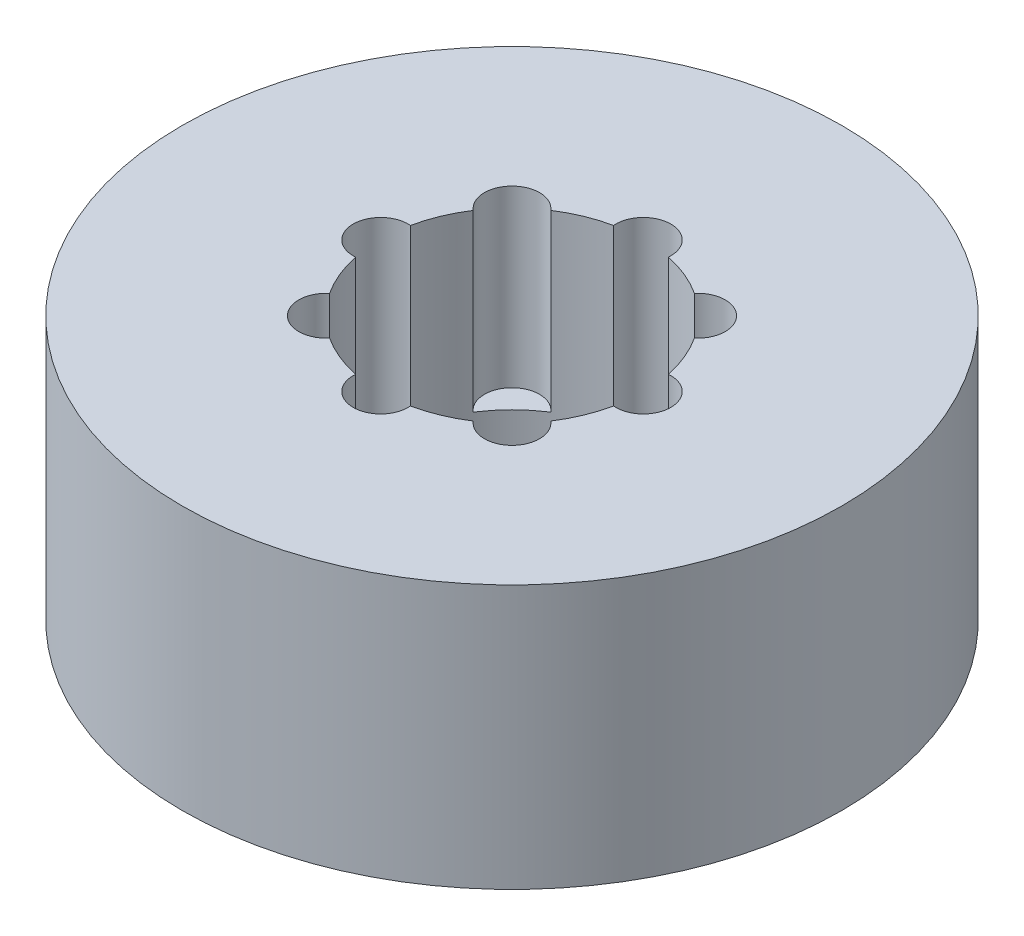
ISO-10303-21;
HEADER;
FILE_DESCRIPTION(('STEP AP214'),'2;1');
FILE_NAME('part.step','',(''),(''),'','','');
FILE_SCHEMA(('AUTOMOTIVE_DESIGN { 1 0 10303 214 1 1 1 1 }'));
ENDSEC;
DATA;
#1=APPLICATION_CONTEXT('core data for automotive mechanical design processes');
#2=APPLICATION_PROTOCOL_DEFINITION('international standard','automotive_design',2000,#1);
#3=PRODUCT_CONTEXT('',#1,'mechanical');
#4=PRODUCT('Part','Part','',(#3));
#5=PRODUCT_RELATED_PRODUCT_CATEGORY('part','',(#4));
#6=PRODUCT_DEFINITION_FORMATION('','',#4);
#7=PRODUCT_DEFINITION_CONTEXT('part definition',#1,'design');
#8=PRODUCT_DEFINITION('design','',#6,#7);
#9=PRODUCT_DEFINITION_SHAPE('','',#8);
#10=(LENGTH_UNIT() NAMED_UNIT(*) SI_UNIT(.MILLI.,.METRE.));
#11=(NAMED_UNIT(*) PLANE_ANGLE_UNIT() SI_UNIT($,.RADIAN.));
#12=(NAMED_UNIT(*) SI_UNIT($,.STERADIAN.) SOLID_ANGLE_UNIT());
#13=UNCERTAINTY_MEASURE_WITH_UNIT(LENGTH_MEASURE(1.E-05),#10,'distance_accuracy_value','');
#14=(GEOMETRIC_REPRESENTATION_CONTEXT(3) GLOBAL_UNCERTAINTY_ASSIGNED_CONTEXT((#13)) GLOBAL_UNIT_ASSIGNED_CONTEXT((#10,
#11,#12)) REPRESENTATION_CONTEXT('',''));
#15=CARTESIAN_POINT('',(0.,0.,0.));
#16=DIRECTION('',(0.,0.,1.));
#17=DIRECTION('',(1.,0.,0.));
#18=AXIS2_PLACEMENT_3D('',#15,#16,#17);
#19=CARTESIAN_POINT('',(0.,20.,0.));
#20=DIRECTION('',(0.,-1.,0.));
#21=DIRECTION('',(0.,0.,-1.));
#22=AXIS2_PLACEMENT_3D('',#19,#20,#21);
#23=CYLINDRICAL_SURFACE('',#22,25.);
#24=CARTESIAN_POINT('',(0.,20.,0.));
#25=DIRECTION('',(0.,1.,0.));
#26=DIRECTION('',(0.,0.,1.));
#27=AXIS2_PLACEMENT_3D('',#24,#25,#26);
#28=CIRCLE('',#27,25.);
#29=CARTESIAN_POINT('',(0.,20.,25.));
#30=VERTEX_POINT('',#29);
#31=EDGE_CURVE('E195',#30,#30,#28,.T.);
#32=ORIENTED_EDGE('',*,*,#31,.F.);
#33=EDGE_LOOP('',(#32));
#34=FACE_BOUND('',#33,.T.);
#35=CARTESIAN_POINT('',(0.,0.,0.));
#36=DIRECTION('',(0.,1.,0.));
#37=DIRECTION('',(0.,0.,1.));
#38=AXIS2_PLACEMENT_3D('',#35,#36,#37);
#39=CIRCLE('',#38,25.);
#40=CARTESIAN_POINT('',(0.,0.,25.));
#41=VERTEX_POINT('',#40);
#42=EDGE_CURVE('E179',#41,#41,#39,.T.);
#43=ORIENTED_EDGE('',*,*,#42,.T.);
#44=EDGE_LOOP('',(#43));
#45=FACE_BOUND('',#44,.T.);
#46=ADVANCED_FACE('F39',(#34,#45),#23,.T.);
#47=CARTESIAN_POINT('',(0.,20.,0.));
#48=DIRECTION('',(0.,1.,0.));
#49=DIRECTION('',(0.,0.,1.));
#50=AXIS2_PLACEMENT_3D('',#47,#48,#49);
#51=PLANE('',#50);
#52=CARTESIAN_POINT('',(0.,20.,9.95756158068621));
#53=DIRECTION('',(0.,1.,0.));
#54=DIRECTION('',(1.,0.,0.));
#55=AXIS2_PLACEMENT_3D('',#52,#53,#54);
#56=CIRCLE('',#55,2.08700614775945);
#57=CARTESIAN_POINT('',(-2.07955658889209,20.,9.78138253998869));
#58=VERTEX_POINT('',#57);
#59=CARTESIAN_POINT('',(2.07955658889215,20.,9.78138253998867));
#60=VERTEX_POINT('',#59);
#61=EDGE_CURVE('E176',#58,#60,#56,.T.);
#62=ORIENTED_EDGE('',*,*,#61,.F.);
#63=CARTESIAN_POINT('',(0.,20.,0.));
#64=DIRECTION('',(0.,1.,0.));
#65=DIRECTION('',(0.,0.,1.));
#66=AXIS2_PLACEMENT_3D('',#63,#64,#65);
#67=CIRCLE('',#66,10.);
#68=CARTESIAN_POINT('',(-5.44601335753889,20.,8.38695048927248));
#69=VERTEX_POINT('',#68);
#70=EDGE_CURVE('E166',#69,#58,#67,.T.);
#71=ORIENTED_EDGE('',*,*,#70,.F.);
#72=CARTESIAN_POINT('',(-7.04105931778585,20.,7.04105931778587));
#73=DIRECTION('',(0.,1.,0.));
#74=DIRECTION('',(0.707106781186549,0.,0.707106781186546));
#75=AXIS2_PLACEMENT_3D('',#72,#73,#74);
#76=CIRCLE('',#75,2.08700614775945);
#77=CARTESIAN_POINT('',(-8.38695048927246,20.,5.44601335753892));
#78=VERTEX_POINT('',#77);
#79=EDGE_CURVE('E147',#78,#69,#76,.T.);
#80=ORIENTED_EDGE('',*,*,#79,.F.);
#81=CARTESIAN_POINT('',(-9.78138253998868,20.,2.07955658889212));
#82=VERTEX_POINT('',#81);
#83=EDGE_CURVE('E180',#82,#78,#67,.T.);
#84=ORIENTED_EDGE('',*,*,#83,.F.);
#85=CARTESIAN_POINT('',(-9.95756158068621,20.,0.));
#86=DIRECTION('',(0.,1.,0.));
#87=DIRECTION('',(0.,0.,1.));
#88=AXIS2_PLACEMENT_3D('',#85,#86,#87);
#89=CIRCLE('',#88,2.08700614775945);
#90=CARTESIAN_POINT('',(-9.78138253998868,20.,-2.07955658889212));
#91=VERTEX_POINT('',#90);
#92=EDGE_CURVE('E186',#91,#82,#89,.T.);
#93=ORIENTED_EDGE('',*,*,#92,.F.);
#94=CARTESIAN_POINT('',(-8.38695048927254,20.,-5.44601335753881));
#95=VERTEX_POINT('',#94);
#96=EDGE_CURVE('E182',#95,#91,#67,.T.);
#97=ORIENTED_EDGE('',*,*,#96,.F.);
#98=CARTESIAN_POINT('',(-7.04105931778594,20.,-7.04105931778577));
#99=DIRECTION('',(0.,1.,0.));
#100=DIRECTION('',(-0.707106781186539,0.,0.707106781186556));
#101=AXIS2_PLACEMENT_3D('',#98,#99,#100);
#102=CIRCLE('',#101,2.08700614775945);
#103=CARTESIAN_POINT('',(-5.44601335753901,20.,-8.38695048927241));
#104=VERTEX_POINT('',#103);
#105=EDGE_CURVE('E446',#104,#95,#102,.T.);
#106=ORIENTED_EDGE('',*,*,#105,.F.);
#107=CARTESIAN_POINT('',(-2.07955658889222,20.,-9.78138253998866));
#108=VERTEX_POINT('',#107);
#109=EDGE_CURVE('E452',#108,#104,#67,.T.);
#110=ORIENTED_EDGE('',*,*,#109,.F.);
#111=CARTESIAN_POINT('',(-1.04299921318042E-13,20.,-9.95756158068621));
#112=DIRECTION('',(0.,1.,0.));
#113=DIRECTION('',(-1.,0.,0.));
#114=AXIS2_PLACEMENT_3D('',#111,#112,#113);
#115=CIRCLE('',#114,2.08700614775945);
#116=CARTESIAN_POINT('',(2.07955658889202,20.,-9.7813825399887));
#117=VERTEX_POINT('',#116);
#118=EDGE_CURVE('E477',#117,#108,#115,.T.);
#119=ORIENTED_EDGE('',*,*,#118,.F.);
#120=CARTESIAN_POINT('',(5.44601335753883,20.,-8.38695048927252));
#121=VERTEX_POINT('',#120);
#122=EDGE_CURVE('E460',#121,#117,#67,.T.);
#123=ORIENTED_EDGE('',*,*,#122,.F.);
#124=CARTESIAN_POINT('',(7.0410593177858,20.,-7.04105931778592));
#125=DIRECTION('',(0.,1.,0.));
#126=DIRECTION('',(-0.707106781186554,0.,-0.707106781186541));
#127=AXIS2_PLACEMENT_3D('',#124,#125,#126);
#128=CIRCLE('',#127,2.08700614775945);
#129=CARTESIAN_POINT('',(8.38695048927243,20.,-5.44601335753898));
#130=VERTEX_POINT('',#129);
#131=EDGE_CURVE('E464',#130,#121,#128,.T.);
#132=ORIENTED_EDGE('',*,*,#131,.F.);
#133=CARTESIAN_POINT('',(9.78138253998868,20.,-2.07955658889212));
#134=VERTEX_POINT('',#133);
#135=EDGE_CURVE('E459',#134,#130,#67,.T.);
#136=ORIENTED_EDGE('',*,*,#135,.F.);
#137=CARTESIAN_POINT('',(9.95756158068621,20.,0.));
#138=DIRECTION('',(0.,1.,0.));
#139=DIRECTION('',(0.,0.,-1.));
#140=AXIS2_PLACEMENT_3D('',#137,#138,#139);
#141=CIRCLE('',#140,2.08700614775945);
#142=CARTESIAN_POINT('',(9.78138253998868,20.,2.07955658889212));
#143=VERTEX_POINT('',#142);
#144=EDGE_CURVE('E469',#143,#134,#141,.T.);
#145=ORIENTED_EDGE('',*,*,#144,.F.);
#146=CARTESIAN_POINT('',(8.3869504892725,20.,5.44601335753886));
#147=VERTEX_POINT('',#146);
#148=EDGE_CURVE('E181',#147,#143,#67,.T.);
#149=ORIENTED_EDGE('',*,*,#148,.F.);
#150=CARTESIAN_POINT('',(7.0410593177859,20.,7.04105931778582));
#151=DIRECTION('',(0.,1.,0.));
#152=DIRECTION('',(0.707106781186544,0.,-0.707106781186551));
#153=AXIS2_PLACEMENT_3D('',#150,#151,#152);
#154=CIRCLE('',#153,2.08700614775945);
#155=CARTESIAN_POINT('',(5.44601335753895,20.,8.38695048927245));
#156=VERTEX_POINT('',#155);
#157=EDGE_CURVE('E475',#156,#147,#154,.T.);
#158=ORIENTED_EDGE('',*,*,#157,.F.);
#159=EDGE_CURVE('E177',#60,#156,#67,.T.);
#160=ORIENTED_EDGE('',*,*,#159,.F.);
#161=EDGE_LOOP('',(#62,#71,#80,#84,#93,#97,#106,#110,#119,#123,#132,#136,#145,#149,#158,#160));
#162=FACE_BOUND('',#161,.T.);
#163=ORIENTED_EDGE('',*,*,#31,.T.);
#164=EDGE_LOOP('',(#163));
#165=FACE_BOUND('',#164,.T.);
#166=ADVANCED_FACE('F172',(#162,#165),#51,.T.);
#167=CARTESIAN_POINT('',(0.,0.,0.));
#168=DIRECTION('',(0.,1.,0.));
#169=DIRECTION('',(0.,0.,1.));
#170=AXIS2_PLACEMENT_3D('',#167,#168,#169);
#171=PLANE('',#170);
#172=CARTESIAN_POINT('',(0.,0.,0.));
#173=DIRECTION('',(0.,1.,0.));
#174=DIRECTION('',(0.,0.,1.));
#175=AXIS2_PLACEMENT_3D('',#172,#173,#174);
#176=CIRCLE('',#175,10.);
#177=CARTESIAN_POINT('',(0.,0.,10.));
#178=VERTEX_POINT('',#177);
#179=EDGE_CURVE('E187',#178,#178,#176,.T.);
#180=ORIENTED_EDGE('',*,*,#179,.T.);
#181=EDGE_LOOP('',(#180));
#182=FACE_BOUND('',#181,.T.);
#183=ORIENTED_EDGE('',*,*,#42,.F.);
#184=EDGE_LOOP('',(#183));
#185=FACE_BOUND('',#184,.T.);
#186=ADVANCED_FACE('F270',(#182,#185),#171,.F.);
#187=CARTESIAN_POINT('',(0.,20.,0.));
#188=DIRECTION('',(0.,-1.,0.));
#189=DIRECTION('',(0.,0.,-1.));
#190=AXIS2_PLACEMENT_3D('',#187,#188,#189);
#191=CYLINDRICAL_SURFACE('',#190,10.);
#192=DIRECTION('',(0.,1.,0.));
#193=VECTOR('',#192,1.);
#194=CARTESIAN_POINT('',(-2.07955658889209,13.3775208247682,9.78138253998869));
#195=LINE('',#194,#193);
#196=CARTESIAN_POINT('',(-2.07955658889209,6.75504164953644,9.78138253998869));
#197=VERTEX_POINT('',#196);
#198=EDGE_CURVE('E11',#197,#58,#195,.T.);
#199=ORIENTED_EDGE('',*,*,#198,.F.);
#200=CARTESIAN_POINT('',(0.,6.75504164953644,0.));
#201=DIRECTION('',(0.,1.,0.));
#202=DIRECTION('',(0.,0.,1.));
#203=AXIS2_PLACEMENT_3D('',#200,#201,#202);
#204=CIRCLE('',#203,10.);
#205=CARTESIAN_POINT('',(2.07955658889215,6.75504164953644,9.78138253998867));
#206=VERTEX_POINT('',#205);
#207=EDGE_CURVE('E250',#197,#206,#204,.T.);
#208=ORIENTED_EDGE('',*,*,#207,.T.);
#209=DIRECTION('',(0.,1.,0.));
#210=VECTOR('',#209,1.);
#211=CARTESIAN_POINT('',(2.07955658889215,13.3775208247682,9.78138253998867));
#212=LINE('',#211,#210);
#213=EDGE_CURVE('E46',#60,#206,#212,.F.);
#214=ORIENTED_EDGE('',*,*,#213,.F.);
#215=ORIENTED_EDGE('',*,*,#159,.T.);
#216=DIRECTION('',(0.,1.,0.));
#217=VECTOR('',#216,1.);
#218=CARTESIAN_POINT('',(5.44601335753895,13.3775208247682,8.38695048927245));
#219=LINE('',#218,#217);
#220=CARTESIAN_POINT('',(5.44601335753895,6.75504164953644,8.38695048927245));
#221=VERTEX_POINT('',#220);
#222=EDGE_CURVE('E244',#221,#156,#219,.T.);
#223=ORIENTED_EDGE('',*,*,#222,.F.);
#224=CARTESIAN_POINT('',(0.,6.75504164953644,0.));
#225=DIRECTION('',(0.,1.,0.));
#226=DIRECTION('',(0.,0.,1.));
#227=AXIS2_PLACEMENT_3D('',#224,#225,#226);
#228=CIRCLE('',#227,10.);
#229=CARTESIAN_POINT('',(8.3869504892725,6.75504164953644,5.44601335753886));
#230=VERTEX_POINT('',#229);
#231=EDGE_CURVE('E238',#221,#230,#228,.T.);
#232=ORIENTED_EDGE('',*,*,#231,.T.);
#233=DIRECTION('',(0.,1.,0.));
#234=VECTOR('',#233,1.);
#235=CARTESIAN_POINT('',(8.3869504892725,13.3775208247682,5.44601335753886));
#236=LINE('',#235,#234);
#237=EDGE_CURVE('E242',#147,#230,#236,.F.);
#238=ORIENTED_EDGE('',*,*,#237,.F.);
#239=ORIENTED_EDGE('',*,*,#148,.T.);
#240=DIRECTION('',(0.,1.,0.));
#241=VECTOR('',#240,1.);
#242=CARTESIAN_POINT('',(9.78138253998868,13.3775208247682,2.07955658889212));
#243=LINE('',#242,#241);
#244=CARTESIAN_POINT('',(9.78138253998868,6.75504164953644,2.07955658889212));
#245=VERTEX_POINT('',#244);
#246=EDGE_CURVE('E236',#245,#143,#243,.T.);
#247=ORIENTED_EDGE('',*,*,#246,.F.);
#248=CARTESIAN_POINT('',(0.,6.75504164953644,0.));
#249=DIRECTION('',(0.,1.,0.));
#250=DIRECTION('',(0.,0.,1.));
#251=AXIS2_PLACEMENT_3D('',#248,#249,#250);
#252=CIRCLE('',#251,10.);
#253=CARTESIAN_POINT('',(9.78138253998868,6.75504164953644,-2.07955658889212));
#254=VERTEX_POINT('',#253);
#255=EDGE_CURVE('E235',#245,#254,#252,.T.);
#256=ORIENTED_EDGE('',*,*,#255,.T.);
#257=DIRECTION('',(0.,1.,0.));
#258=VECTOR('',#257,1.);
#259=CARTESIAN_POINT('',(9.78138253998868,13.3775208247682,-2.07955658889212));
#260=LINE('',#259,#258);
#261=EDGE_CURVE('E234',#134,#254,#260,.F.);
#262=ORIENTED_EDGE('',*,*,#261,.F.);
#263=ORIENTED_EDGE('',*,*,#135,.T.);
#264=DIRECTION('',(0.,1.,0.));
#265=VECTOR('',#264,1.);
#266=CARTESIAN_POINT('',(8.38695048927243,13.3775208247682,-5.44601335753898));
#267=LINE('',#266,#265);
#268=CARTESIAN_POINT('',(8.38695048927243,6.75504164953644,-5.44601335753898));
#269=VERTEX_POINT('',#268);
#270=EDGE_CURVE('E229',#269,#130,#267,.T.);
#271=ORIENTED_EDGE('',*,*,#270,.F.);
#272=CARTESIAN_POINT('',(0.,6.75504164953644,0.));
#273=DIRECTION('',(0.,1.,0.));
#274=DIRECTION('',(0.,0.,1.));
#275=AXIS2_PLACEMENT_3D('',#272,#273,#274);
#276=CIRCLE('',#275,10.);
#277=CARTESIAN_POINT('',(5.44601335753883,6.75504164953644,-8.38695048927252));
#278=VERTEX_POINT('',#277);
#279=EDGE_CURVE('E221',#269,#278,#276,.T.);
#280=ORIENTED_EDGE('',*,*,#279,.T.);
#281=DIRECTION('',(0.,1.,0.));
#282=VECTOR('',#281,1.);
#283=CARTESIAN_POINT('',(5.44601335753883,13.3775208247682,-8.38695048927252));
#284=LINE('',#283,#282);
#285=EDGE_CURVE('E230',#121,#278,#284,.F.);
#286=ORIENTED_EDGE('',*,*,#285,.F.);
#287=ORIENTED_EDGE('',*,*,#122,.T.);
#288=DIRECTION('',(0.,1.,0.));
#289=VECTOR('',#288,1.);
#290=CARTESIAN_POINT('',(2.07955658889202,13.3775208247682,-9.7813825399887));
#291=LINE('',#290,#289);
#292=CARTESIAN_POINT('',(2.07955658889202,6.75504164953644,-9.7813825399887));
#293=VERTEX_POINT('',#292);
#294=EDGE_CURVE('E225',#293,#117,#291,.T.);
#295=ORIENTED_EDGE('',*,*,#294,.F.);
#296=CARTESIAN_POINT('',(0.,6.75504164953644,0.));
#297=DIRECTION('',(0.,1.,0.));
#298=DIRECTION('',(0.,0.,1.));
#299=AXIS2_PLACEMENT_3D('',#296,#297,#298);
#300=CIRCLE('',#299,10.);
#301=CARTESIAN_POINT('',(-2.07955658889222,6.75504164953644,-9.78138253998866));
#302=VERTEX_POINT('',#301);
#303=EDGE_CURVE('E216',#293,#302,#300,.T.);
#304=ORIENTED_EDGE('',*,*,#303,.T.);
#305=DIRECTION('',(0.,1.,0.));
#306=VECTOR('',#305,1.);
#307=CARTESIAN_POINT('',(-2.07955658889222,13.3775208247682,-9.78138253998866));
#308=LINE('',#307,#306);
#309=EDGE_CURVE('E218',#108,#302,#308,.F.);
#310=ORIENTED_EDGE('',*,*,#309,.F.);
#311=ORIENTED_EDGE('',*,*,#109,.T.);
#312=DIRECTION('',(0.,1.,0.));
#313=VECTOR('',#312,1.);
#314=CARTESIAN_POINT('',(-5.44601335753901,13.3775208247682,-8.38695048927241));
#315=LINE('',#314,#313);
#316=CARTESIAN_POINT('',(-5.44601335753901,6.75504164953644,-8.38695048927241));
#317=VERTEX_POINT('',#316);
#318=EDGE_CURVE('E212',#317,#104,#315,.T.);
#319=ORIENTED_EDGE('',*,*,#318,.F.);
#320=CARTESIAN_POINT('',(0.,6.75504164953644,0.));
#321=DIRECTION('',(0.,1.,0.));
#322=DIRECTION('',(0.,0.,1.));
#323=AXIS2_PLACEMENT_3D('',#320,#321,#322);
#324=CIRCLE('',#323,10.);
#325=CARTESIAN_POINT('',(-8.38695048927254,6.75504164953644,-5.44601335753881));
#326=VERTEX_POINT('',#325);
#327=EDGE_CURVE('E208',#317,#326,#324,.T.);
#328=ORIENTED_EDGE('',*,*,#327,.T.);
#329=DIRECTION('',(0.,1.,0.));
#330=VECTOR('',#329,1.);
#331=CARTESIAN_POINT('',(-8.38695048927254,13.3775208247682,-5.44601335753881));
#332=LINE('',#331,#330);
#333=EDGE_CURVE('E211',#95,#326,#332,.F.);
#334=ORIENTED_EDGE('',*,*,#333,.F.);
#335=ORIENTED_EDGE('',*,*,#96,.T.);
#336=DIRECTION('',(0.,1.,0.));
#337=VECTOR('',#336,1.);
#338=CARTESIAN_POINT('',(-9.78138253998868,13.3775208247682,-2.07955658889212));
#339=LINE('',#338,#337);
#340=CARTESIAN_POINT('',(-9.78138253998868,6.75504164953644,-2.07955658889212));
#341=VERTEX_POINT('',#340);
#342=EDGE_CURVE('E201',#341,#91,#339,.T.);
#343=ORIENTED_EDGE('',*,*,#342,.F.);
#344=CARTESIAN_POINT('',(0.,6.75504164953644,0.));
#345=DIRECTION('',(0.,1.,0.));
#346=DIRECTION('',(0.,0.,1.));
#347=AXIS2_PLACEMENT_3D('',#344,#345,#346);
#348=CIRCLE('',#347,10.);
#349=CARTESIAN_POINT('',(-9.78138253998868,6.75504164953644,2.07955658889212));
#350=VERTEX_POINT('',#349);
#351=EDGE_CURVE('E194',#341,#350,#348,.T.);
#352=ORIENTED_EDGE('',*,*,#351,.T.);
#353=DIRECTION('',(0.,1.,0.));
#354=VECTOR('',#353,1.);
#355=CARTESIAN_POINT('',(-9.78138253998868,13.3775208247682,2.07955658889212));
#356=LINE('',#355,#354);
#357=EDGE_CURVE('E199',#82,#350,#356,.F.);
#358=ORIENTED_EDGE('',*,*,#357,.F.);
#359=ORIENTED_EDGE('',*,*,#83,.T.);
#360=DIRECTION('',(0.,1.,0.));
#361=VECTOR('',#360,1.);
#362=CARTESIAN_POINT('',(-8.38695048927247,13.3775208247682,5.44601335753892));
#363=LINE('',#362,#361);
#364=CARTESIAN_POINT('',(-8.38695048927246,6.75504164953644,5.44601335753892));
#365=VERTEX_POINT('',#364);
#366=EDGE_CURVE('E160',#365,#78,#363,.T.);
#367=ORIENTED_EDGE('',*,*,#366,.F.);
#368=CARTESIAN_POINT('',(0.,6.75504164953644,0.));
#369=DIRECTION('',(0.,1.,0.));
#370=DIRECTION('',(0.,0.,1.));
#371=AXIS2_PLACEMENT_3D('',#368,#369,#370);
#372=CIRCLE('',#371,10.);
#373=CARTESIAN_POINT('',(-5.44601335753889,6.75504164953644,8.38695048927248));
#374=VERTEX_POINT('',#373);
#375=EDGE_CURVE('E168',#365,#374,#372,.T.);
#376=ORIENTED_EDGE('',*,*,#375,.T.);
#377=DIRECTION('',(0.,1.,0.));
#378=VECTOR('',#377,1.);
#379=CARTESIAN_POINT('',(-5.44601335753889,13.3775208247682,8.38695048927248));
#380=LINE('',#379,#378);
#381=EDGE_CURVE('E152',#69,#374,#380,.F.);
#382=ORIENTED_EDGE('',*,*,#381,.F.);
#383=ORIENTED_EDGE('',*,*,#70,.T.);
#384=EDGE_LOOP('',(#199,#208,#214,#215,#223,#232,#238,#239,#247,#256,#262,#263,#271,#280,#286,
#287,#295,#304,#310,#311,#319,#328,#334,#335,#343,#352,#358,#359,#367,#376,#382,#383));
#385=FACE_BOUND('',#384,.T.);
#386=ORIENTED_EDGE('',*,*,#179,.F.);
#387=EDGE_LOOP('',(#386));
#388=FACE_BOUND('',#387,.T.);
#389=ADVANCED_FACE('F170',(#385,#388),#191,.F.);
#390=CARTESIAN_POINT('',(-9.95756158068621,6.75504164953644,0.));
#391=DIRECTION('',(0.,1.,0.));
#392=DIRECTION('',(0.,0.,1.));
#393=AXIS2_PLACEMENT_3D('',#390,#391,#392);
#394=CYLINDRICAL_SURFACE('',#393,2.08700614775945);
#395=ORIENTED_EDGE('',*,*,#342,.T.);
#396=ORIENTED_EDGE('',*,*,#92,.T.);
#397=ORIENTED_EDGE('',*,*,#357,.T.);
#398=CARTESIAN_POINT('',(-9.95756158068621,6.75504164953644,0.));
#399=DIRECTION('',(0.,1.,0.));
#400=DIRECTION('',(0.,0.,1.));
#401=AXIS2_PLACEMENT_3D('',#398,#399,#400);
#402=CIRCLE('',#401,2.08700614775945);
#403=EDGE_CURVE('E191',#341,#350,#402,.T.);
#404=ORIENTED_EDGE('',*,*,#403,.F.);
#405=EDGE_LOOP('',(#395,#396,#397,#404));
#406=FACE_BOUND('',#405,.T.);
#407=ADVANCED_FACE('F279',(#406),#394,.F.);
#408=CARTESIAN_POINT('',(-9.95756158068621,6.75504164953644,0.));
#409=DIRECTION('',(0.,1.,0.));
#410=DIRECTION('',(0.,0.,1.));
#411=AXIS2_PLACEMENT_3D('',#408,#409,#410);
#412=PLANE('',#411);
#413=ORIENTED_EDGE('',*,*,#403,.T.);
#414=ORIENTED_EDGE('',*,*,#351,.F.);
#415=EDGE_LOOP('',(#413,#414));
#416=FACE_BOUND('',#415,.T.);
#417=ADVANCED_FACE('F285',(#416),#412,.T.);
#418=CARTESIAN_POINT('',(-7.04105931778585,6.75504164953644,7.04105931778587));
#419=DIRECTION('',(0.,1.,0.));
#420=DIRECTION('',(0.,0.,1.));
#421=AXIS2_PLACEMENT_3D('',#418,#419,#420);
#422=CYLINDRICAL_SURFACE('',#421,2.08700614775945);
#423=ORIENTED_EDGE('',*,*,#366,.T.);
#424=ORIENTED_EDGE('',*,*,#79,.T.);
#425=ORIENTED_EDGE('',*,*,#381,.T.);
#426=CARTESIAN_POINT('',(-7.04105931778585,6.75504164953644,7.04105931778587));
#427=DIRECTION('',(0.,1.,0.));
#428=DIRECTION('',(0.707106781186549,0.,0.707106781186546));
#429=AXIS2_PLACEMENT_3D('',#426,#427,#428);
#430=CIRCLE('',#429,2.08700614775945);
#431=EDGE_CURVE('E165',#365,#374,#430,.T.);
#432=ORIENTED_EDGE('',*,*,#431,.F.);
#433=EDGE_LOOP('',(#423,#424,#425,#432));
#434=FACE_BOUND('',#433,.T.);
#435=ADVANCED_FACE('F155',(#434),#422,.F.);
#436=CARTESIAN_POINT('',(-7.04105931778585,6.75504164953644,7.04105931778587));
#437=DIRECTION('',(0.,1.,0.));
#438=DIRECTION('',(0.707106781186549,0.,0.707106781186546));
#439=AXIS2_PLACEMENT_3D('',#436,#437,#438);
#440=PLANE('',#439);
#441=ORIENTED_EDGE('',*,*,#431,.T.);
#442=ORIENTED_EDGE('',*,*,#375,.F.);
#443=EDGE_LOOP('',(#441,#442));
#444=FACE_BOUND('',#443,.T.);
#445=ADVANCED_FACE('F288',(#444),#440,.T.);
#446=CARTESIAN_POINT('',(-7.04105931778594,6.75504164953644,-7.04105931778577));
#447=DIRECTION('',(0.,1.,0.));
#448=DIRECTION('',(0.,0.,1.));
#449=AXIS2_PLACEMENT_3D('',#446,#447,#448);
#450=CYLINDRICAL_SURFACE('',#449,2.08700614775945);
#451=ORIENTED_EDGE('',*,*,#318,.T.);
#452=ORIENTED_EDGE('',*,*,#105,.T.);
#453=ORIENTED_EDGE('',*,*,#333,.T.);
#454=CARTESIAN_POINT('',(-7.04105931778594,6.75504164953644,-7.04105931778577));
#455=DIRECTION('',(0.,1.,0.));
#456=DIRECTION('',(-0.707106781186539,0.,0.707106781186556));
#457=AXIS2_PLACEMENT_3D('',#454,#455,#456);
#458=CIRCLE('',#457,2.08700614775945);
#459=EDGE_CURVE('E447',#317,#326,#458,.T.);
#460=ORIENTED_EDGE('',*,*,#459,.F.);
#461=EDGE_LOOP('',(#451,#452,#453,#460));
#462=FACE_BOUND('',#461,.T.);
#463=ADVANCED_FACE('F295',(#462),#450,.F.);
#464=CARTESIAN_POINT('',(-7.04105931778594,6.75504164953644,-7.04105931778577));
#465=DIRECTION('',(0.,1.,0.));
#466=DIRECTION('',(-0.707106781186539,0.,0.707106781186556));
#467=AXIS2_PLACEMENT_3D('',#464,#465,#466);
#468=PLANE('',#467);
#469=ORIENTED_EDGE('',*,*,#459,.T.);
#470=ORIENTED_EDGE('',*,*,#327,.F.);
#471=EDGE_LOOP('',(#469,#470));
#472=FACE_BOUND('',#471,.T.);
#473=ADVANCED_FACE('F375',(#472),#468,.T.);
#474=CARTESIAN_POINT('',(-1.04299921318042E-13,6.75504164953644,-9.95756158068621));
#475=DIRECTION('',(0.,1.,0.));
#476=DIRECTION('',(0.,0.,1.));
#477=AXIS2_PLACEMENT_3D('',#474,#475,#476);
#478=CYLINDRICAL_SURFACE('',#477,2.08700614775945);
#479=ORIENTED_EDGE('',*,*,#294,.T.);
#480=ORIENTED_EDGE('',*,*,#118,.T.);
#481=ORIENTED_EDGE('',*,*,#309,.T.);
#482=CARTESIAN_POINT('',(-1.04299921318042E-13,6.75504164953644,-9.95756158068621));
#483=DIRECTION('',(0.,1.,0.));
#484=DIRECTION('',(-1.,0.,0.));
#485=AXIS2_PLACEMENT_3D('',#482,#483,#484);
#486=CIRCLE('',#485,2.08700614775945);
#487=EDGE_CURVE('E467',#293,#302,#486,.T.);
#488=ORIENTED_EDGE('',*,*,#487,.F.);
#489=EDGE_LOOP('',(#479,#480,#481,#488));
#490=FACE_BOUND('',#489,.T.);
#491=ADVANCED_FACE('F361',(#490),#478,.F.);
#492=CARTESIAN_POINT('',(-1.04299921318042E-13,6.75504164953644,-9.95756158068621));
#493=DIRECTION('',(0.,1.,0.));
#494=DIRECTION('',(-1.,0.,0.));
#495=AXIS2_PLACEMENT_3D('',#492,#493,#494);
#496=PLANE('',#495);
#497=ORIENTED_EDGE('',*,*,#487,.T.);
#498=ORIENTED_EDGE('',*,*,#303,.F.);
#499=EDGE_LOOP('',(#497,#498));
#500=FACE_BOUND('',#499,.T.);
#501=ADVANCED_FACE('F297',(#500),#496,.T.);
#502=CARTESIAN_POINT('',(7.0410593177858,6.75504164953644,-7.04105931778592));
#503=DIRECTION('',(0.,1.,0.));
#504=DIRECTION('',(0.,0.,1.));
#505=AXIS2_PLACEMENT_3D('',#502,#503,#504);
#506=CYLINDRICAL_SURFACE('',#505,2.08700614775945);
#507=ORIENTED_EDGE('',*,*,#270,.T.);
#508=ORIENTED_EDGE('',*,*,#131,.T.);
#509=ORIENTED_EDGE('',*,*,#285,.T.);
#510=CARTESIAN_POINT('',(7.0410593177858,6.75504164953644,-7.04105931778592));
#511=DIRECTION('',(0.,1.,0.));
#512=DIRECTION('',(-0.707106781186554,0.,-0.707106781186541));
#513=AXIS2_PLACEMENT_3D('',#510,#511,#512);
#514=CIRCLE('',#513,2.08700614775945);
#515=EDGE_CURVE('E470',#269,#278,#514,.T.);
#516=ORIENTED_EDGE('',*,*,#515,.F.);
#517=EDGE_LOOP('',(#507,#508,#509,#516));
#518=FACE_BOUND('',#517,.T.);
#519=ADVANCED_FACE('F294',(#518),#506,.F.);
#520=CARTESIAN_POINT('',(7.0410593177858,6.75504164953644,-7.04105931778592));
#521=DIRECTION('',(0.,1.,0.));
#522=DIRECTION('',(-0.707106781186554,0.,-0.707106781186541));
#523=AXIS2_PLACEMENT_3D('',#520,#521,#522);
#524=PLANE('',#523);
#525=ORIENTED_EDGE('',*,*,#515,.T.);
#526=ORIENTED_EDGE('',*,*,#279,.F.);
#527=EDGE_LOOP('',(#525,#526));
#528=FACE_BOUND('',#527,.T.);
#529=ADVANCED_FACE('F300',(#528),#524,.T.);
#530=CARTESIAN_POINT('',(9.95756158068621,6.75504164953644,0.));
#531=DIRECTION('',(0.,1.,0.));
#532=DIRECTION('',(0.,0.,1.));
#533=AXIS2_PLACEMENT_3D('',#530,#531,#532);
#534=CYLINDRICAL_SURFACE('',#533,2.08700614775945);
#535=ORIENTED_EDGE('',*,*,#246,.T.);
#536=ORIENTED_EDGE('',*,*,#144,.T.);
#537=ORIENTED_EDGE('',*,*,#261,.T.);
#538=CARTESIAN_POINT('',(9.95756158068621,6.75504164953644,0.));
#539=DIRECTION('',(0.,1.,0.));
#540=DIRECTION('',(0.,0.,-1.));
#541=AXIS2_PLACEMENT_3D('',#538,#539,#540);
#542=CIRCLE('',#541,2.08700614775945);
#543=EDGE_CURVE('E472',#245,#254,#542,.T.);
#544=ORIENTED_EDGE('',*,*,#543,.F.);
#545=EDGE_LOOP('',(#535,#536,#537,#544));
#546=FACE_BOUND('',#545,.T.);
#547=ADVANCED_FACE('F305',(#546),#534,.F.);
#548=CARTESIAN_POINT('',(9.95756158068621,6.75504164953644,0.));
#549=DIRECTION('',(0.,1.,0.));
#550=DIRECTION('',(0.,0.,-1.));
#551=AXIS2_PLACEMENT_3D('',#548,#549,#550);
#552=PLANE('',#551);
#553=ORIENTED_EDGE('',*,*,#543,.T.);
#554=ORIENTED_EDGE('',*,*,#255,.F.);
#555=EDGE_LOOP('',(#553,#554));
#556=FACE_BOUND('',#555,.T.);
#557=ADVANCED_FACE('F308',(#556),#552,.T.);
#558=CARTESIAN_POINT('',(7.0410593177859,6.75504164953644,7.04105931778582));
#559=DIRECTION('',(0.,1.,0.));
#560=DIRECTION('',(0.,0.,1.));
#561=AXIS2_PLACEMENT_3D('',#558,#559,#560);
#562=CYLINDRICAL_SURFACE('',#561,2.08700614775945);
#563=ORIENTED_EDGE('',*,*,#222,.T.);
#564=ORIENTED_EDGE('',*,*,#157,.T.);
#565=ORIENTED_EDGE('',*,*,#237,.T.);
#566=CARTESIAN_POINT('',(7.0410593177859,6.75504164953644,7.04105931778582));
#567=DIRECTION('',(0.,1.,0.));
#568=DIRECTION('',(0.707106781186544,0.,-0.707106781186551));
#569=AXIS2_PLACEMENT_3D('',#566,#567,#568);
#570=CIRCLE('',#569,2.08700614775945);
#571=EDGE_CURVE('E56',#221,#230,#570,.T.);
#572=ORIENTED_EDGE('',*,*,#571,.F.);
#573=EDGE_LOOP('',(#563,#564,#565,#572));
#574=FACE_BOUND('',#573,.T.);
#575=ADVANCED_FACE('F309',(#574),#562,.F.);
#576=CARTESIAN_POINT('',(7.0410593177859,6.75504164953644,7.04105931778582));
#577=DIRECTION('',(0.,1.,0.));
#578=DIRECTION('',(0.707106781186544,0.,-0.707106781186551));
#579=AXIS2_PLACEMENT_3D('',#576,#577,#578);
#580=PLANE('',#579);
#581=ORIENTED_EDGE('',*,*,#571,.T.);
#582=ORIENTED_EDGE('',*,*,#231,.F.);
#583=EDGE_LOOP('',(#581,#582));
#584=FACE_BOUND('',#583,.T.);
#585=ADVANCED_FACE('F256',(#584),#580,.T.);
#586=CARTESIAN_POINT('',(0.,6.75504164953644,9.95756158068621));
#587=DIRECTION('',(0.,1.,0.));
#588=DIRECTION('',(0.,0.,1.));
#589=AXIS2_PLACEMENT_3D('',#586,#587,#588);
#590=CYLINDRICAL_SURFACE('',#589,2.08700614775945);
#591=ORIENTED_EDGE('',*,*,#198,.T.);
#592=ORIENTED_EDGE('',*,*,#61,.T.);
#593=ORIENTED_EDGE('',*,*,#213,.T.);
#594=CARTESIAN_POINT('',(0.,6.75504164953644,9.95756158068621));
#595=DIRECTION('',(0.,1.,0.));
#596=DIRECTION('',(1.,0.,0.));
#597=AXIS2_PLACEMENT_3D('',#594,#595,#596);
#598=CIRCLE('',#597,2.08700614775945);
#599=EDGE_CURVE('E55',#197,#206,#598,.T.);
#600=ORIENTED_EDGE('',*,*,#599,.F.);
#601=EDGE_LOOP('',(#591,#592,#593,#600));
#602=FACE_BOUND('',#601,.T.);
#603=ADVANCED_FACE('F253',(#602),#590,.F.);
#604=CARTESIAN_POINT('',(0.,6.75504164953644,9.95756158068621));
#605=DIRECTION('',(0.,1.,0.));
#606=DIRECTION('',(1.,0.,0.));
#607=AXIS2_PLACEMENT_3D('',#604,#605,#606);
#608=PLANE('',#607);
#609=ORIENTED_EDGE('',*,*,#599,.T.);
#610=ORIENTED_EDGE('',*,*,#207,.F.);
#611=EDGE_LOOP('',(#609,#610));
#612=FACE_BOUND('',#611,.T.);
#613=ADVANCED_FACE('F252',(#612),#608,.T.);
#614=CLOSED_SHELL('',(#46,#166,#186,#389,#407,#417,#435,#445,#463,#473,#491,#501,#519,#529,#547,
#557,#575,#585,#603,#613));
#615=MANIFOLD_SOLID_BREP('B2',#614);
#616=ADVANCED_BREP_SHAPE_REPRESENTATION('',(#18,#615),#14);
#617=SHAPE_DEFINITION_REPRESENTATION(#9,#616);
ENDSEC;
END-ISO-10303-21;
